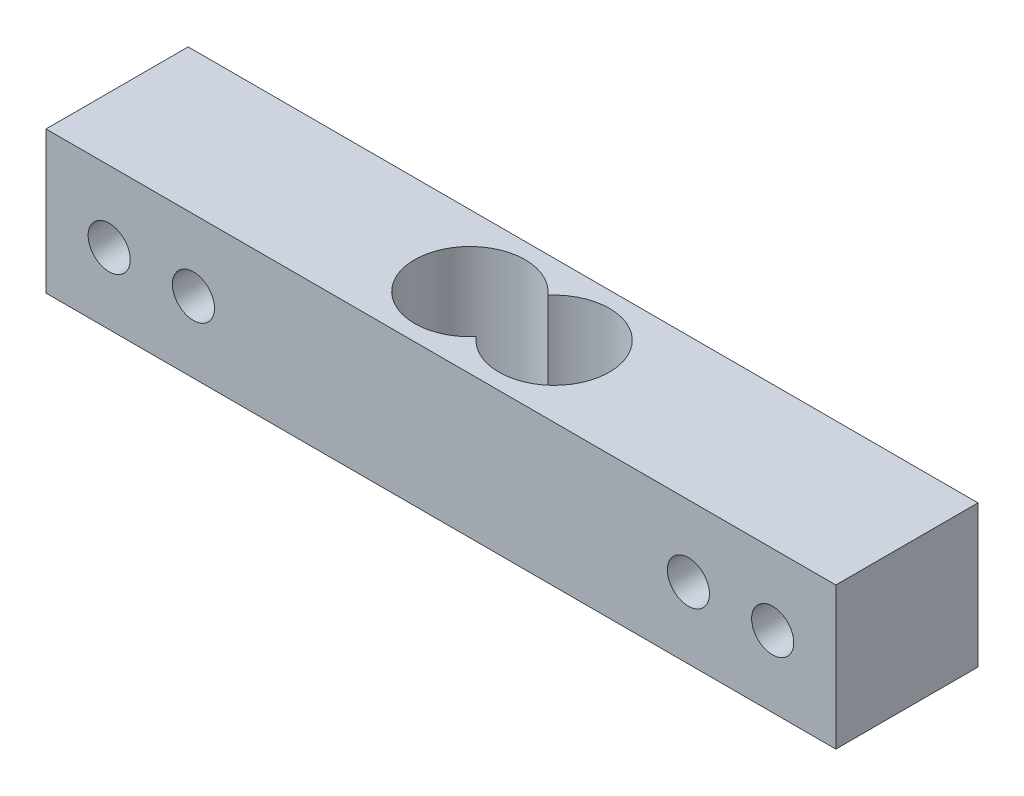
ISO-10303-21;
HEADER;
FILE_DESCRIPTION(('STEP AP214'),'2;1');
FILE_NAME('part.step','',(''),(''),'','','');
FILE_SCHEMA(('AUTOMOTIVE_DESIGN { 1 0 10303 214 1 1 1 1 }'));
ENDSEC;
DATA;
#1=APPLICATION_CONTEXT('core data for automotive mechanical design processes');
#2=APPLICATION_PROTOCOL_DEFINITION('international standard','automotive_design',2000,#1);
#3=PRODUCT_CONTEXT('',#1,'mechanical');
#4=PRODUCT('Part','Part','',(#3));
#5=PRODUCT_RELATED_PRODUCT_CATEGORY('part','',(#4));
#6=PRODUCT_DEFINITION_FORMATION('','',#4);
#7=PRODUCT_DEFINITION_CONTEXT('part definition',#1,'design');
#8=PRODUCT_DEFINITION('design','',#6,#7);
#9=PRODUCT_DEFINITION_SHAPE('','',#8);
#10=(LENGTH_UNIT() NAMED_UNIT(*) SI_UNIT(.MILLI.,.METRE.));
#11=(NAMED_UNIT(*) PLANE_ANGLE_UNIT() SI_UNIT($,.RADIAN.));
#12=(NAMED_UNIT(*) SI_UNIT($,.STERADIAN.) SOLID_ANGLE_UNIT());
#13=UNCERTAINTY_MEASURE_WITH_UNIT(LENGTH_MEASURE(1.E-05),#10,'distance_accuracy_value','');
#14=(GEOMETRIC_REPRESENTATION_CONTEXT(3) GLOBAL_UNCERTAINTY_ASSIGNED_CONTEXT((#13)) GLOBAL_UNIT_ASSIGNED_CONTEXT((#10,
#11,#12)) REPRESENTATION_CONTEXT('',''));
#15=CARTESIAN_POINT('',(0.,0.,0.));
#16=DIRECTION('',(0.,0.,1.));
#17=DIRECTION('',(1.,0.,0.));
#18=AXIS2_PLACEMENT_3D('',#15,#16,#17);
#19=CARTESIAN_POINT('',(0.,0.,13.5));
#20=DIRECTION('',(0.,0.,1.));
#21=DIRECTION('',(1.,0.,0.));
#22=AXIS2_PLACEMENT_3D('',#19,#20,#21);
#23=PLANE('',#22);
#24=CARTESIAN_POINT('',(69.,6.75,13.5));
#25=DIRECTION('',(0.,0.,1.));
#26=DIRECTION('',(1.,0.,0.));
#27=AXIS2_PLACEMENT_3D('',#24,#25,#26);
#28=CIRCLE('',#27,2.);
#29=CARTESIAN_POINT('',(71.,6.75,13.5));
#30=VERTEX_POINT('',#29);
#31=EDGE_CURVE('E109',#30,#30,#28,.T.);
#32=ORIENTED_EDGE('',*,*,#31,.F.);
#33=EDGE_LOOP('',(#32));
#34=FACE_BOUND('',#33,.T.);
#35=CARTESIAN_POINT('',(6.,6.75,13.5));
#36=DIRECTION('',(0.,0.,1.));
#37=DIRECTION('',(1.,0.,0.));
#38=AXIS2_PLACEMENT_3D('',#35,#36,#37);
#39=CIRCLE('',#38,2.);
#40=CARTESIAN_POINT('',(8.,6.75,13.5));
#41=VERTEX_POINT('',#40);
#42=EDGE_CURVE('E121',#41,#41,#39,.T.);
#43=ORIENTED_EDGE('',*,*,#42,.F.);
#44=EDGE_LOOP('',(#43));
#45=FACE_BOUND('',#44,.T.);
#46=DIRECTION('',(0.,-1.,0.));
#47=VECTOR('',#46,1.);
#48=CARTESIAN_POINT('',(0.,13.5,13.5));
#49=LINE('',#48,#47);
#50=CARTESIAN_POINT('',(0.,13.5,13.5));
#51=VERTEX_POINT('',#50);
#52=CARTESIAN_POINT('',(0.,0.,13.5));
#53=VERTEX_POINT('',#52);
#54=EDGE_CURVE('E127',#51,#53,#49,.T.);
#55=ORIENTED_EDGE('',*,*,#54,.T.);
#56=DIRECTION('',(1.,0.,0.));
#57=VECTOR('',#56,1.);
#58=CARTESIAN_POINT('',(0.,0.,13.5));
#59=LINE('',#58,#57);
#60=CARTESIAN_POINT('',(75.,0.,13.5));
#61=VERTEX_POINT('',#60);
#62=EDGE_CURVE('E130',#53,#61,#59,.T.);
#63=ORIENTED_EDGE('',*,*,#62,.T.);
#64=DIRECTION('',(0.,1.,0.));
#65=VECTOR('',#64,1.);
#66=CARTESIAN_POINT('',(75.,0.,13.5));
#67=LINE('',#66,#65);
#68=CARTESIAN_POINT('',(75.,13.5,13.5));
#69=VERTEX_POINT('',#68);
#70=EDGE_CURVE('E133',#61,#69,#67,.T.);
#71=ORIENTED_EDGE('',*,*,#70,.T.);
#72=DIRECTION('',(-1.,0.,0.));
#73=VECTOR('',#72,1.);
#74=CARTESIAN_POINT('',(75.,13.5,13.5));
#75=LINE('',#74,#73);
#76=EDGE_CURVE('E135',#69,#51,#75,.T.);
#77=ORIENTED_EDGE('',*,*,#76,.T.);
#78=EDGE_LOOP('',(#55,#63,#71,#77));
#79=FACE_BOUND('',#78,.T.);
#80=CARTESIAN_POINT('',(14.,6.75,13.5));
#81=DIRECTION('',(0.,0.,1.));
#82=DIRECTION('',(1.,0.,0.));
#83=AXIS2_PLACEMENT_3D('',#80,#81,#82);
#84=CIRCLE('',#83,2.);
#85=CARTESIAN_POINT('',(16.,6.75,13.5));
#86=VERTEX_POINT('',#85);
#87=EDGE_CURVE('E115',#86,#86,#84,.T.);
#88=ORIENTED_EDGE('',*,*,#87,.F.);
#89=EDGE_LOOP('',(#88));
#90=FACE_BOUND('',#89,.T.);
#91=CARTESIAN_POINT('',(61.,6.75,13.5));
#92=DIRECTION('',(0.,0.,1.));
#93=DIRECTION('',(1.,0.,0.));
#94=AXIS2_PLACEMENT_3D('',#91,#92,#93);
#95=CIRCLE('',#94,1.99999999999999);
#96=CARTESIAN_POINT('',(63.,6.75,13.5));
#97=VERTEX_POINT('',#96);
#98=EDGE_CURVE('E103',#97,#97,#95,.T.);
#99=ORIENTED_EDGE('',*,*,#98,.F.);
#100=EDGE_LOOP('',(#99));
#101=FACE_BOUND('',#100,.T.);
#102=ADVANCED_FACE('F32',(#34,#45,#79,#90,#101),#23,.T.);
#103=CARTESIAN_POINT('',(0.,0.,0.));
#104=DIRECTION('',(0.,0.,1.));
#105=DIRECTION('',(1.,0.,0.));
#106=AXIS2_PLACEMENT_3D('',#103,#104,#105);
#107=PLANE('',#106);
#108=DIRECTION('',(0.,-1.,0.));
#109=VECTOR('',#108,1.);
#110=CARTESIAN_POINT('',(0.,13.5,0.));
#111=LINE('',#110,#109);
#112=CARTESIAN_POINT('',(0.,13.5,0.));
#113=VERTEX_POINT('',#112);
#114=CARTESIAN_POINT('',(0.,0.,0.));
#115=VERTEX_POINT('',#114);
#116=EDGE_CURVE('E124',#113,#115,#111,.T.);
#117=ORIENTED_EDGE('',*,*,#116,.F.);
#118=DIRECTION('',(-1.,0.,0.));
#119=VECTOR('',#118,1.);
#120=CARTESIAN_POINT('',(75.,13.5,0.));
#121=LINE('',#120,#119);
#122=CARTESIAN_POINT('',(75.,13.5,0.));
#123=VERTEX_POINT('',#122);
#124=EDGE_CURVE('E131',#123,#113,#121,.T.);
#125=ORIENTED_EDGE('',*,*,#124,.F.);
#126=DIRECTION('',(0.,1.,0.));
#127=VECTOR('',#126,1.);
#128=CARTESIAN_POINT('',(75.,0.,0.));
#129=LINE('',#128,#127);
#130=CARTESIAN_POINT('',(75.,0.,0.));
#131=VERTEX_POINT('',#130);
#132=EDGE_CURVE('E142',#131,#123,#129,.T.);
#133=ORIENTED_EDGE('',*,*,#132,.F.);
#134=DIRECTION('',(1.,0.,0.));
#135=VECTOR('',#134,1.);
#136=CARTESIAN_POINT('',(0.,0.,0.));
#137=LINE('',#136,#135);
#138=EDGE_CURVE('E140',#115,#131,#137,.T.);
#139=ORIENTED_EDGE('',*,*,#138,.F.);
#140=EDGE_LOOP('',(#117,#125,#133,#139));
#141=FACE_BOUND('',#140,.T.);
#142=CARTESIAN_POINT('',(6.,6.75,0.));
#143=DIRECTION('',(0.,0.,1.));
#144=DIRECTION('',(1.,0.,0.));
#145=AXIS2_PLACEMENT_3D('',#142,#143,#144);
#146=CIRCLE('',#145,2.);
#147=CARTESIAN_POINT('',(8.,6.75,0.));
#148=VERTEX_POINT('',#147);
#149=EDGE_CURVE('E118',#148,#148,#146,.T.);
#150=ORIENTED_EDGE('',*,*,#149,.T.);
#151=EDGE_LOOP('',(#150));
#152=FACE_BOUND('',#151,.T.);
#153=CARTESIAN_POINT('',(14.,6.75,0.));
#154=DIRECTION('',(0.,0.,1.));
#155=DIRECTION('',(1.,0.,0.));
#156=AXIS2_PLACEMENT_3D('',#153,#154,#155);
#157=CIRCLE('',#156,2.);
#158=CARTESIAN_POINT('',(16.,6.75,0.));
#159=VERTEX_POINT('',#158);
#160=EDGE_CURVE('E112',#159,#159,#157,.T.);
#161=ORIENTED_EDGE('',*,*,#160,.T.);
#162=EDGE_LOOP('',(#161));
#163=FACE_BOUND('',#162,.T.);
#164=CARTESIAN_POINT('',(69.,6.75,0.));
#165=DIRECTION('',(0.,0.,1.));
#166=DIRECTION('',(1.,0.,0.));
#167=AXIS2_PLACEMENT_3D('',#164,#165,#166);
#168=CIRCLE('',#167,2.);
#169=CARTESIAN_POINT('',(71.,6.75,0.));
#170=VERTEX_POINT('',#169);
#171=EDGE_CURVE('E106',#170,#170,#168,.T.);
#172=ORIENTED_EDGE('',*,*,#171,.T.);
#173=EDGE_LOOP('',(#172));
#174=FACE_BOUND('',#173,.T.);
#175=CARTESIAN_POINT('',(61.,6.75,0.));
#176=DIRECTION('',(0.,0.,1.));
#177=DIRECTION('',(1.,0.,0.));
#178=AXIS2_PLACEMENT_3D('',#175,#176,#177);
#179=CIRCLE('',#178,1.99999999999999);
#180=CARTESIAN_POINT('',(63.,6.75,0.));
#181=VERTEX_POINT('',#180);
#182=EDGE_CURVE('E101',#181,#181,#179,.T.);
#183=ORIENTED_EDGE('',*,*,#182,.T.);
#184=EDGE_LOOP('',(#183));
#185=FACE_BOUND('',#184,.T.);
#186=ADVANCED_FACE('F159',(#141,#152,#163,#174,#185),#107,.F.);
#187=CARTESIAN_POINT('',(0.,13.5,13.5));
#188=DIRECTION('',(1.,0.,0.));
#189=DIRECTION('',(0.,0.,-1.));
#190=AXIS2_PLACEMENT_3D('',#187,#188,#189);
#191=PLANE('',#190);
#192=ORIENTED_EDGE('',*,*,#116,.T.);
#193=DIRECTION('',(0.,0.,-1.));
#194=VECTOR('',#193,1.);
#195=CARTESIAN_POINT('',(0.,0.,13.5));
#196=LINE('',#195,#194);
#197=EDGE_CURVE('E11',#53,#115,#196,.T.);
#198=ORIENTED_EDGE('',*,*,#197,.F.);
#199=ORIENTED_EDGE('',*,*,#54,.F.);
#200=DIRECTION('',(0.,0.,-1.));
#201=VECTOR('',#200,1.);
#202=CARTESIAN_POINT('',(0.,13.5,13.5));
#203=LINE('',#202,#201);
#204=EDGE_CURVE('E137',#51,#113,#203,.T.);
#205=ORIENTED_EDGE('',*,*,#204,.T.);
#206=EDGE_LOOP('',(#192,#198,#199,#205));
#207=FACE_BOUND('',#206,.T.);
#208=ADVANCED_FACE('F34',(#207),#191,.F.);
#209=CARTESIAN_POINT('',(0.,0.,13.5));
#210=DIRECTION('',(0.,1.,0.));
#211=DIRECTION('',(0.,0.,1.));
#212=AXIS2_PLACEMENT_3D('',#209,#210,#211);
#213=PLANE('',#212);
#214=CARTESIAN_POINT('',(33.5,0.,6.75));
#215=DIRECTION('',(0.,1.,0.));
#216=DIRECTION('',(0.,0.,1.));
#217=AXIS2_PLACEMENT_3D('',#214,#215,#216);
#218=CIRCLE('',#217,5.25);
#219=CARTESIAN_POINT('',(37.5,0.,3.34963237281614));
#220=VERTEX_POINT('',#219);
#221=CARTESIAN_POINT('',(37.5,0.,10.1503676271839));
#222=VERTEX_POINT('',#221);
#223=EDGE_CURVE('E88',#220,#222,#218,.T.);
#224=ORIENTED_EDGE('',*,*,#223,.T.);
#225=CARTESIAN_POINT('',(41.5,0.,6.75));
#226=DIRECTION('',(0.,1.,0.));
#227=DIRECTION('',(0.,0.,1.));
#228=AXIS2_PLACEMENT_3D('',#225,#226,#227);
#229=CIRCLE('',#228,5.25);
#230=EDGE_CURVE('E47',#222,#220,#229,.T.);
#231=ORIENTED_EDGE('',*,*,#230,.T.);
#232=EDGE_LOOP('',(#224,#231));
#233=FACE_BOUND('',#232,.T.);
#234=ORIENTED_EDGE('',*,*,#138,.T.);
#235=DIRECTION('',(0.,0.,-1.));
#236=VECTOR('',#235,1.);
#237=CARTESIAN_POINT('',(75.,0.,13.5));
#238=LINE('',#237,#236);
#239=EDGE_CURVE('E40',#61,#131,#238,.T.);
#240=ORIENTED_EDGE('',*,*,#239,.F.);
#241=ORIENTED_EDGE('',*,*,#62,.F.);
#242=ORIENTED_EDGE('',*,*,#197,.T.);
#243=EDGE_LOOP('',(#234,#240,#241,#242));
#244=FACE_BOUND('',#243,.T.);
#245=ADVANCED_FACE('F94',(#233,#244),#213,.F.);
#246=CARTESIAN_POINT('',(75.,0.,13.5));
#247=DIRECTION('',(-1.,0.,0.));
#248=DIRECTION('',(0.,0.,1.));
#249=AXIS2_PLACEMENT_3D('',#246,#247,#248);
#250=PLANE('',#249);
#251=ORIENTED_EDGE('',*,*,#132,.T.);
#252=DIRECTION('',(0.,0.,-1.));
#253=VECTOR('',#252,1.);
#254=CARTESIAN_POINT('',(75.,13.5,13.5));
#255=LINE('',#254,#253);
#256=EDGE_CURVE('E147',#69,#123,#255,.T.);
#257=ORIENTED_EDGE('',*,*,#256,.F.);
#258=ORIENTED_EDGE('',*,*,#70,.F.);
#259=ORIENTED_EDGE('',*,*,#239,.T.);
#260=EDGE_LOOP('',(#251,#257,#258,#259));
#261=FACE_BOUND('',#260,.T.);
#262=ADVANCED_FACE('F154',(#261),#250,.F.);
#263=CARTESIAN_POINT('',(75.,13.5,13.5));
#264=DIRECTION('',(0.,-1.,0.));
#265=DIRECTION('',(0.,0.,-1.));
#266=AXIS2_PLACEMENT_3D('',#263,#264,#265);
#267=PLANE('',#266);
#268=CARTESIAN_POINT('',(33.5,13.5,6.75));
#269=DIRECTION('',(0.,1.,0.));
#270=DIRECTION('',(0.,0.,1.));
#271=AXIS2_PLACEMENT_3D('',#268,#269,#270);
#272=CIRCLE('',#271,5.25);
#273=CARTESIAN_POINT('',(37.5,13.5,3.34963237281614));
#274=VERTEX_POINT('',#273);
#275=CARTESIAN_POINT('',(37.5,13.5,10.1503676271839));
#276=VERTEX_POINT('',#275);
#277=EDGE_CURVE('E96',#274,#276,#272,.T.);
#278=ORIENTED_EDGE('',*,*,#277,.F.);
#279=CARTESIAN_POINT('',(41.5,13.5,6.75));
#280=DIRECTION('',(0.,1.,0.));
#281=DIRECTION('',(0.,0.,1.));
#282=AXIS2_PLACEMENT_3D('',#279,#280,#281);
#283=CIRCLE('',#282,5.25);
#284=EDGE_CURVE('E52',#276,#274,#283,.T.);
#285=ORIENTED_EDGE('',*,*,#284,.F.);
#286=EDGE_LOOP('',(#278,#285));
#287=FACE_BOUND('',#286,.T.);
#288=ORIENTED_EDGE('',*,*,#124,.T.);
#289=ORIENTED_EDGE('',*,*,#204,.F.);
#290=ORIENTED_EDGE('',*,*,#76,.F.);
#291=ORIENTED_EDGE('',*,*,#256,.T.);
#292=EDGE_LOOP('',(#288,#289,#290,#291));
#293=FACE_BOUND('',#292,.T.);
#294=ADVANCED_FACE('F163',(#287,#293),#267,.F.);
#295=CARTESIAN_POINT('',(6.,6.75,13.5));
#296=DIRECTION('',(0.,0.,-1.));
#297=DIRECTION('',(-1.,0.,0.));
#298=AXIS2_PLACEMENT_3D('',#295,#296,#297);
#299=CYLINDRICAL_SURFACE('',#298,2.);
#300=ORIENTED_EDGE('',*,*,#42,.T.);
#301=EDGE_LOOP('',(#300));
#302=FACE_BOUND('',#301,.T.);
#303=ORIENTED_EDGE('',*,*,#149,.F.);
#304=EDGE_LOOP('',(#303));
#305=FACE_BOUND('',#304,.T.);
#306=ADVANCED_FACE('F186',(#302,#305),#299,.F.);
#307=CARTESIAN_POINT('',(14.,6.75,13.5));
#308=DIRECTION('',(0.,0.,-1.));
#309=DIRECTION('',(-1.,0.,0.));
#310=AXIS2_PLACEMENT_3D('',#307,#308,#309);
#311=CYLINDRICAL_SURFACE('',#310,2.);
#312=ORIENTED_EDGE('',*,*,#87,.T.);
#313=EDGE_LOOP('',(#312));
#314=FACE_BOUND('',#313,.T.);
#315=ORIENTED_EDGE('',*,*,#160,.F.);
#316=EDGE_LOOP('',(#315));
#317=FACE_BOUND('',#316,.T.);
#318=ADVANCED_FACE('F194',(#314,#317),#311,.F.);
#319=CARTESIAN_POINT('',(69.,6.75,13.5));
#320=DIRECTION('',(0.,0.,-1.));
#321=DIRECTION('',(-1.,0.,0.));
#322=AXIS2_PLACEMENT_3D('',#319,#320,#321);
#323=CYLINDRICAL_SURFACE('',#322,2.);
#324=ORIENTED_EDGE('',*,*,#31,.T.);
#325=EDGE_LOOP('',(#324));
#326=FACE_BOUND('',#325,.T.);
#327=ORIENTED_EDGE('',*,*,#171,.F.);
#328=EDGE_LOOP('',(#327));
#329=FACE_BOUND('',#328,.T.);
#330=ADVANCED_FACE('F199',(#326,#329),#323,.F.);
#331=CARTESIAN_POINT('',(61.,6.75,13.5));
#332=DIRECTION('',(0.,0.,-1.));
#333=DIRECTION('',(-1.,0.,0.));
#334=AXIS2_PLACEMENT_3D('',#331,#332,#333);
#335=CYLINDRICAL_SURFACE('',#334,1.99999999999999);
#336=ORIENTED_EDGE('',*,*,#98,.T.);
#337=EDGE_LOOP('',(#336));
#338=FACE_BOUND('',#337,.T.);
#339=ORIENTED_EDGE('',*,*,#182,.F.);
#340=EDGE_LOOP('',(#339));
#341=FACE_BOUND('',#340,.T.);
#342=ADVANCED_FACE('F211',(#338,#341),#335,.F.);
#343=CARTESIAN_POINT('',(41.5,0.,6.75));
#344=DIRECTION('',(0.,1.,0.));
#345=DIRECTION('',(0.,0.,1.));
#346=AXIS2_PLACEMENT_3D('',#343,#344,#345);
#347=CYLINDRICAL_SURFACE('',#346,5.25);
#348=ORIENTED_EDGE('',*,*,#284,.T.);
#349=DIRECTION('',(0.,1.,0.));
#350=VECTOR('',#349,1.);
#351=CARTESIAN_POINT('',(37.5,0.,3.34963237281614));
#352=LINE('',#351,#350);
#353=EDGE_CURVE('E81',#220,#274,#352,.T.);
#354=ORIENTED_EDGE('',*,*,#353,.F.);
#355=ORIENTED_EDGE('',*,*,#230,.F.);
#356=DIRECTION('',(0.,1.,0.));
#357=VECTOR('',#356,1.);
#358=CARTESIAN_POINT('',(37.5,0.,10.1503676271839));
#359=LINE('',#358,#357);
#360=EDGE_CURVE('E87',#222,#276,#359,.T.);
#361=ORIENTED_EDGE('',*,*,#360,.T.);
#362=EDGE_LOOP('',(#348,#354,#355,#361));
#363=FACE_BOUND('',#362,.T.);
#364=ADVANCED_FACE('F83',(#363),#347,.F.);
#365=CARTESIAN_POINT('',(33.5,0.,6.75));
#366=DIRECTION('',(0.,1.,0.));
#367=DIRECTION('',(0.,0.,1.));
#368=AXIS2_PLACEMENT_3D('',#365,#366,#367);
#369=CYLINDRICAL_SURFACE('',#368,5.25);
#370=ORIENTED_EDGE('',*,*,#277,.T.);
#371=ORIENTED_EDGE('',*,*,#360,.F.);
#372=ORIENTED_EDGE('',*,*,#223,.F.);
#373=ORIENTED_EDGE('',*,*,#353,.T.);
#374=EDGE_LOOP('',(#370,#371,#372,#373));
#375=FACE_BOUND('',#374,.T.);
#376=ADVANCED_FACE('F91',(#375),#369,.F.);
#377=CLOSED_SHELL('',(#102,#186,#208,#245,#262,#294,#306,#318,#330,#342,#364,#376));
#378=MANIFOLD_SOLID_BREP('B2',#377);
#379=ADVANCED_BREP_SHAPE_REPRESENTATION('',(#18,#378),#14);
#380=SHAPE_DEFINITION_REPRESENTATION(#9,#379);
ENDSEC;
END-ISO-10303-21;
